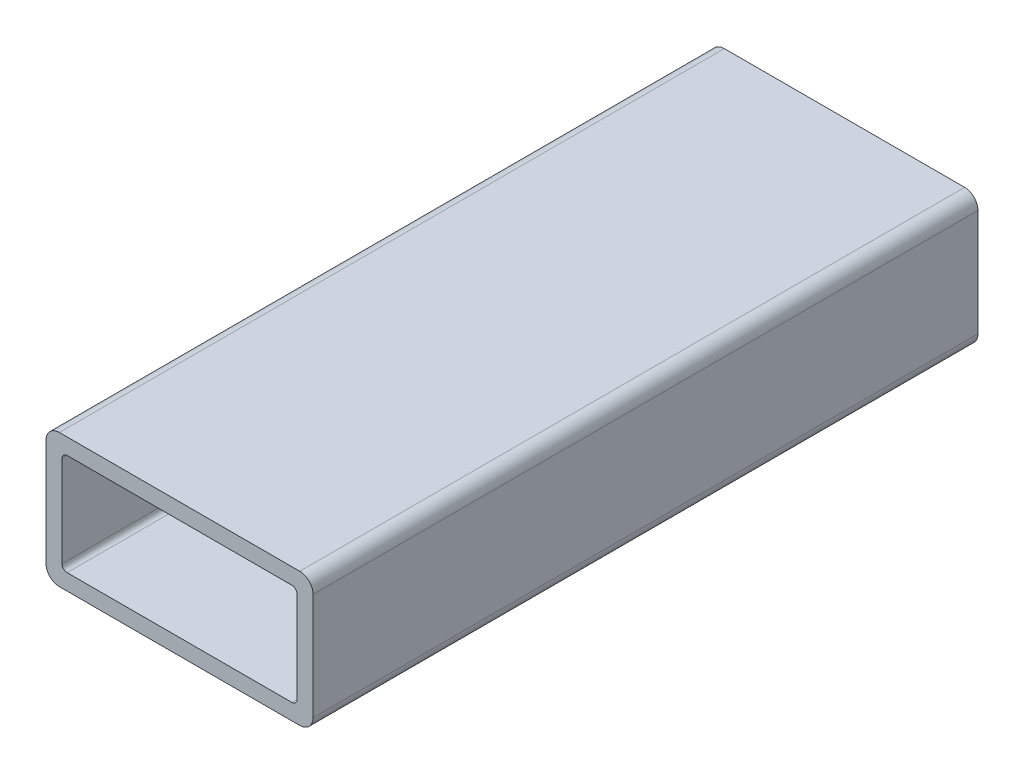
ISO-10303-21;
HEADER;
FILE_DESCRIPTION(('STEP AP214'),'2;1');
FILE_NAME('part.step','',(''),(''),'','','');
FILE_SCHEMA(('AUTOMOTIVE_DESIGN { 1 0 10303 214 1 1 1 1 }'));
ENDSEC;
DATA;
#1=APPLICATION_CONTEXT('core data for automotive mechanical design processes');
#2=APPLICATION_PROTOCOL_DEFINITION('international standard','automotive_design',2000,#1);
#3=PRODUCT_CONTEXT('',#1,'mechanical');
#4=PRODUCT('Part','Part','',(#3));
#5=PRODUCT_RELATED_PRODUCT_CATEGORY('part','',(#4));
#6=PRODUCT_DEFINITION_FORMATION('','',#4);
#7=PRODUCT_DEFINITION_CONTEXT('part definition',#1,'design');
#8=PRODUCT_DEFINITION('design','',#6,#7);
#9=PRODUCT_DEFINITION_SHAPE('','',#8);
#10=(LENGTH_UNIT() NAMED_UNIT(*) SI_UNIT(.MILLI.,.METRE.));
#11=(NAMED_UNIT(*) PLANE_ANGLE_UNIT() SI_UNIT($,.RADIAN.));
#12=(NAMED_UNIT(*) SI_UNIT($,.STERADIAN.) SOLID_ANGLE_UNIT());
#13=UNCERTAINTY_MEASURE_WITH_UNIT(LENGTH_MEASURE(1.E-05),#10,'distance_accuracy_value','');
#14=(GEOMETRIC_REPRESENTATION_CONTEXT(3) GLOBAL_UNCERTAINTY_ASSIGNED_CONTEXT((#13)) GLOBAL_UNIT_ASSIGNED_CONTEXT((#10,
#11,#12)) REPRESENTATION_CONTEXT('',''));
#15=CARTESIAN_POINT('',(0.,0.,0.));
#16=DIRECTION('',(0.,0.,1.));
#17=DIRECTION('',(1.,0.,0.));
#18=AXIS2_PLACEMENT_3D('',#15,#16,#17);
#19=CARTESIAN_POINT('',(22.86,-10.16,126.48184));
#20=DIRECTION('',(0.,0.,1.));
#21=DIRECTION('',(1.,0.,0.));
#22=AXIS2_PLACEMENT_3D('',#19,#20,#21);
#23=PLANE('',#22);
#24=CARTESIAN_POINT('',(22.86,-10.16,126.48184));
#25=DIRECTION('',(0.,0.,1.));
#26=DIRECTION('',(1.,0.,0.));
#27=AXIS2_PLACEMENT_3D('',#24,#25,#26);
#28=CIRCLE('',#27,2.54);
#29=CARTESIAN_POINT('',(22.86,-12.7,126.48184));
#30=VERTEX_POINT('',#29);
#31=CARTESIAN_POINT('',(25.4,-10.16,126.48184));
#32=VERTEX_POINT('',#31);
#33=EDGE_CURVE('E244',#30,#32,#28,.T.);
#34=ORIENTED_EDGE('',*,*,#33,.T.);
#35=DIRECTION('',(0.,1.,0.));
#36=VECTOR('',#35,1.);
#37=CARTESIAN_POINT('',(25.4,-10.16,126.48184));
#38=LINE('',#37,#36);
#39=CARTESIAN_POINT('',(25.4,10.16,126.48184));
#40=VERTEX_POINT('',#39);
#41=EDGE_CURVE('E248',#32,#40,#38,.T.);
#42=ORIENTED_EDGE('',*,*,#41,.T.);
#43=CARTESIAN_POINT('',(22.86,10.16,126.48184));
#44=DIRECTION('',(0.,0.,1.));
#45=DIRECTION('',(1.,0.,0.));
#46=AXIS2_PLACEMENT_3D('',#43,#44,#45);
#47=CIRCLE('',#46,2.54);
#48=CARTESIAN_POINT('',(22.86,12.7,126.48184));
#49=VERTEX_POINT('',#48);
#50=EDGE_CURVE('E252',#40,#49,#47,.T.);
#51=ORIENTED_EDGE('',*,*,#50,.T.);
#52=DIRECTION('',(-1.,0.,0.));
#53=VECTOR('',#52,1.);
#54=CARTESIAN_POINT('',(22.86,12.7,126.48184));
#55=LINE('',#54,#53);
#56=CARTESIAN_POINT('',(-22.86,12.7,126.48184));
#57=VERTEX_POINT('',#56);
#58=EDGE_CURVE('E255',#49,#57,#55,.T.);
#59=ORIENTED_EDGE('',*,*,#58,.T.);
#60=CARTESIAN_POINT('',(-22.86,10.16,126.48184));
#61=DIRECTION('',(0.,0.,1.));
#62=DIRECTION('',(1.,0.,0.));
#63=AXIS2_PLACEMENT_3D('',#60,#61,#62);
#64=CIRCLE('',#63,2.54);
#65=CARTESIAN_POINT('',(-25.4,10.16,126.48184));
#66=VERTEX_POINT('',#65);
#67=EDGE_CURVE('E258',#57,#66,#64,.T.);
#68=ORIENTED_EDGE('',*,*,#67,.T.);
#69=DIRECTION('',(0.,-1.,0.));
#70=VECTOR('',#69,1.);
#71=CARTESIAN_POINT('',(-25.4,-10.16,126.48184));
#72=LINE('',#71,#70);
#73=CARTESIAN_POINT('',(-25.4,-10.16,126.48184));
#74=VERTEX_POINT('',#73);
#75=EDGE_CURVE('E261',#66,#74,#72,.T.);
#76=ORIENTED_EDGE('',*,*,#75,.T.);
#77=CARTESIAN_POINT('',(-22.86,-10.16,126.48184));
#78=DIRECTION('',(0.,0.,1.));
#79=DIRECTION('',(1.,0.,0.));
#80=AXIS2_PLACEMENT_3D('',#77,#78,#79);
#81=CIRCLE('',#80,2.54);
#82=CARTESIAN_POINT('',(-22.86,-12.7,126.48184));
#83=VERTEX_POINT('',#82);
#84=EDGE_CURVE('E264',#74,#83,#81,.T.);
#85=ORIENTED_EDGE('',*,*,#84,.T.);
#86=DIRECTION('',(1.,0.,0.));
#87=VECTOR('',#86,1.);
#88=CARTESIAN_POINT('',(22.86,-12.7,126.48184));
#89=LINE('',#88,#87);
#90=EDGE_CURVE('E267',#83,#30,#89,.T.);
#91=ORIENTED_EDGE('',*,*,#90,.T.);
#92=EDGE_LOOP('',(#34,#42,#51,#59,#68,#76,#85,#91));
#93=FACE_BOUND('',#92,.T.);
#94=DIRECTION('',(-1.,0.,0.));
#95=VECTOR('',#94,1.);
#96=CARTESIAN_POINT('',(21.3868,9.65199999999999,126.48184));
#97=LINE('',#96,#95);
#98=CARTESIAN_POINT('',(21.3868,9.65199999999999,126.48184));
#99=VERTEX_POINT('',#98);
#100=CARTESIAN_POINT('',(-21.3868,9.652,126.48184));
#101=VERTEX_POINT('',#100);
#102=EDGE_CURVE('E164',#99,#101,#97,.T.);
#103=ORIENTED_EDGE('',*,*,#102,.F.);
#104=CARTESIAN_POINT('',(21.3868,8.6868,126.48184));
#105=DIRECTION('',(0.,0.,1.));
#106=DIRECTION('',(1.,0.,0.));
#107=AXIS2_PLACEMENT_3D('',#104,#105,#106);
#108=CIRCLE('',#107,0.965199999999993);
#109=CARTESIAN_POINT('',(22.352,8.68680000000001,126.48184));
#110=VERTEX_POINT('',#109);
#111=EDGE_CURVE('E155',#110,#99,#108,.T.);
#112=ORIENTED_EDGE('',*,*,#111,.F.);
#113=DIRECTION('',(0.,1.,0.));
#114=VECTOR('',#113,1.);
#115=CARTESIAN_POINT('',(22.352,8.68680000000001,126.48184));
#116=LINE('',#115,#114);
#117=CARTESIAN_POINT('',(22.352,-8.6868,126.48184));
#118=VERTEX_POINT('',#117);
#119=EDGE_CURVE('E196',#118,#110,#116,.T.);
#120=ORIENTED_EDGE('',*,*,#119,.F.);
#121=CARTESIAN_POINT('',(21.3868,-8.6868,126.48184));
#122=DIRECTION('',(0.,0.,1.));
#123=DIRECTION('',(1.,0.,0.));
#124=AXIS2_PLACEMENT_3D('',#121,#122,#123);
#125=CIRCLE('',#124,0.965199999999999);
#126=CARTESIAN_POINT('',(21.3868,-9.652,126.48184));
#127=VERTEX_POINT('',#126);
#128=EDGE_CURVE('E193',#127,#118,#125,.T.);
#129=ORIENTED_EDGE('',*,*,#128,.F.);
#130=DIRECTION('',(1.,0.,0.));
#131=VECTOR('',#130,1.);
#132=CARTESIAN_POINT('',(21.3868,-9.652,126.48184));
#133=LINE('',#132,#131);
#134=CARTESIAN_POINT('',(-21.3868,-9.652,126.48184));
#135=VERTEX_POINT('',#134);
#136=EDGE_CURVE('E190',#135,#127,#133,.T.);
#137=ORIENTED_EDGE('',*,*,#136,.F.);
#138=CARTESIAN_POINT('',(-21.3868,-8.6868,126.48184));
#139=DIRECTION('',(0.,0.,1.));
#140=DIRECTION('',(1.,0.,0.));
#141=AXIS2_PLACEMENT_3D('',#138,#139,#140);
#142=CIRCLE('',#141,0.965199999999999);
#143=CARTESIAN_POINT('',(-22.352,-8.6868,126.48184));
#144=VERTEX_POINT('',#143);
#145=EDGE_CURVE('E187',#144,#135,#142,.T.);
#146=ORIENTED_EDGE('',*,*,#145,.F.);
#147=DIRECTION('',(0.,-1.,0.));
#148=VECTOR('',#147,1.);
#149=CARTESIAN_POINT('',(-22.352,8.6868,126.48184));
#150=LINE('',#149,#148);
#151=CARTESIAN_POINT('',(-22.352,8.6868,126.48184));
#152=VERTEX_POINT('',#151);
#153=EDGE_CURVE('E182',#152,#144,#150,.T.);
#154=ORIENTED_EDGE('',*,*,#153,.F.);
#155=CARTESIAN_POINT('',(-21.3868,8.6868,126.48184));
#156=DIRECTION('',(0.,0.,1.));
#157=DIRECTION('',(1.,0.,0.));
#158=AXIS2_PLACEMENT_3D('',#155,#156,#157);
#159=CIRCLE('',#158,0.965199999999999);
#160=EDGE_CURVE('E178',#101,#152,#159,.T.);
#161=ORIENTED_EDGE('',*,*,#160,.F.);
#162=EDGE_LOOP('',(#103,#112,#120,#129,#137,#146,#154,#161));
#163=FACE_BOUND('',#162,.T.);
#164=ADVANCED_FACE('F41',(#93,#163),#23,.T.);
#165=CARTESIAN_POINT('',(22.86,-10.16,0.));
#166=DIRECTION('',(0.,0.,1.));
#167=DIRECTION('',(1.,0.,0.));
#168=AXIS2_PLACEMENT_3D('',#165,#166,#167);
#169=PLANE('',#168);
#170=CARTESIAN_POINT('',(22.86,-10.16,0.));
#171=DIRECTION('',(0.,0.,1.));
#172=DIRECTION('',(1.,0.,0.));
#173=AXIS2_PLACEMENT_3D('',#170,#171,#172);
#174=CIRCLE('',#173,2.54);
#175=CARTESIAN_POINT('',(22.86,-12.7,0.));
#176=VERTEX_POINT('',#175);
#177=CARTESIAN_POINT('',(25.4,-10.16,0.));
#178=VERTEX_POINT('',#177);
#179=EDGE_CURVE('E173',#176,#178,#174,.T.);
#180=ORIENTED_EDGE('',*,*,#179,.F.);
#181=DIRECTION('',(1.,0.,0.));
#182=VECTOR('',#181,1.);
#183=CARTESIAN_POINT('',(22.86,-12.7,0.));
#184=LINE('',#183,#182);
#185=CARTESIAN_POINT('',(-22.86,-12.7,0.));
#186=VERTEX_POINT('',#185);
#187=EDGE_CURVE('E249',#186,#176,#184,.T.);
#188=ORIENTED_EDGE('',*,*,#187,.F.);
#189=CARTESIAN_POINT('',(-22.86,-10.16,0.));
#190=DIRECTION('',(0.,0.,1.));
#191=DIRECTION('',(1.,0.,0.));
#192=AXIS2_PLACEMENT_3D('',#189,#190,#191);
#193=CIRCLE('',#192,2.54);
#194=CARTESIAN_POINT('',(-25.4,-10.16,0.));
#195=VERTEX_POINT('',#194);
#196=EDGE_CURVE('E289',#195,#186,#193,.T.);
#197=ORIENTED_EDGE('',*,*,#196,.F.);
#198=DIRECTION('',(0.,-1.,0.));
#199=VECTOR('',#198,1.);
#200=CARTESIAN_POINT('',(-25.4,-10.16,0.));
#201=LINE('',#200,#199);
#202=CARTESIAN_POINT('',(-25.4,10.16,0.));
#203=VERTEX_POINT('',#202);
#204=EDGE_CURVE('E286',#203,#195,#201,.T.);
#205=ORIENTED_EDGE('',*,*,#204,.F.);
#206=CARTESIAN_POINT('',(-22.86,10.16,0.));
#207=DIRECTION('',(0.,0.,1.));
#208=DIRECTION('',(1.,0.,0.));
#209=AXIS2_PLACEMENT_3D('',#206,#207,#208);
#210=CIRCLE('',#209,2.54);
#211=CARTESIAN_POINT('',(-22.86,12.7,0.));
#212=VERTEX_POINT('',#211);
#213=EDGE_CURVE('E283',#212,#203,#210,.T.);
#214=ORIENTED_EDGE('',*,*,#213,.F.);
#215=DIRECTION('',(-1.,0.,0.));
#216=VECTOR('',#215,1.);
#217=CARTESIAN_POINT('',(22.86,12.7,0.));
#218=LINE('',#217,#216);
#219=CARTESIAN_POINT('',(22.86,12.7,0.));
#220=VERTEX_POINT('',#219);
#221=EDGE_CURVE('E280',#220,#212,#218,.T.);
#222=ORIENTED_EDGE('',*,*,#221,.F.);
#223=CARTESIAN_POINT('',(22.86,10.16,0.));
#224=DIRECTION('',(0.,0.,1.));
#225=DIRECTION('',(1.,0.,0.));
#226=AXIS2_PLACEMENT_3D('',#223,#224,#225);
#227=CIRCLE('',#226,2.54);
#228=CARTESIAN_POINT('',(25.4,10.16,0.));
#229=VERTEX_POINT('',#228);
#230=EDGE_CURVE('E277',#229,#220,#227,.T.);
#231=ORIENTED_EDGE('',*,*,#230,.F.);
#232=DIRECTION('',(0.,1.,0.));
#233=VECTOR('',#232,1.);
#234=CARTESIAN_POINT('',(25.4,-10.16,0.));
#235=LINE('',#234,#233);
#236=EDGE_CURVE('E274',#178,#229,#235,.T.);
#237=ORIENTED_EDGE('',*,*,#236,.F.);
#238=EDGE_LOOP('',(#180,#188,#197,#205,#214,#222,#231,#237));
#239=FACE_BOUND('',#238,.T.);
#240=CARTESIAN_POINT('',(21.3868,8.6868,0.));
#241=DIRECTION('',(0.,0.,1.));
#242=DIRECTION('',(1.,0.,0.));
#243=AXIS2_PLACEMENT_3D('',#240,#241,#242);
#244=CIRCLE('',#243,0.965199999999993);
#245=CARTESIAN_POINT('',(22.352,8.68680000000001,0.));
#246=VERTEX_POINT('',#245);
#247=CARTESIAN_POINT('',(21.3868,9.65199999999999,0.));
#248=VERTEX_POINT('',#247);
#249=EDGE_CURVE('E65',#246,#248,#244,.T.);
#250=ORIENTED_EDGE('',*,*,#249,.T.);
#251=DIRECTION('',(-1.,0.,0.));
#252=VECTOR('',#251,1.);
#253=CARTESIAN_POINT('',(21.3868,9.65199999999999,0.));
#254=LINE('',#253,#252);
#255=CARTESIAN_POINT('',(-21.3868,9.652,0.));
#256=VERTEX_POINT('',#255);
#257=EDGE_CURVE('E171',#248,#256,#254,.T.);
#258=ORIENTED_EDGE('',*,*,#257,.T.);
#259=CARTESIAN_POINT('',(-21.3868,8.6868,0.));
#260=DIRECTION('',(0.,0.,1.));
#261=DIRECTION('',(1.,0.,0.));
#262=AXIS2_PLACEMENT_3D('',#259,#260,#261);
#263=CIRCLE('',#262,0.965199999999999);
#264=CARTESIAN_POINT('',(-22.352,8.6868,0.));
#265=VERTEX_POINT('',#264);
#266=EDGE_CURVE('E203',#256,#265,#263,.T.);
#267=ORIENTED_EDGE('',*,*,#266,.T.);
#268=DIRECTION('',(0.,-1.,0.));
#269=VECTOR('',#268,1.);
#270=CARTESIAN_POINT('',(-22.352,8.6868,0.));
#271=LINE('',#270,#269);
#272=CARTESIAN_POINT('',(-22.352,-8.6868,0.));
#273=VERTEX_POINT('',#272);
#274=EDGE_CURVE('E207',#265,#273,#271,.T.);
#275=ORIENTED_EDGE('',*,*,#274,.T.);
#276=CARTESIAN_POINT('',(-21.3868,-8.6868,0.));
#277=DIRECTION('',(0.,0.,1.));
#278=DIRECTION('',(1.,0.,0.));
#279=AXIS2_PLACEMENT_3D('',#276,#277,#278);
#280=CIRCLE('',#279,0.965199999999999);
#281=CARTESIAN_POINT('',(-21.3868,-9.652,0.));
#282=VERTEX_POINT('',#281);
#283=EDGE_CURVE('E211',#273,#282,#280,.T.);
#284=ORIENTED_EDGE('',*,*,#283,.T.);
#285=DIRECTION('',(1.,0.,0.));
#286=VECTOR('',#285,1.);
#287=CARTESIAN_POINT('',(21.3868,-9.652,0.));
#288=LINE('',#287,#286);
#289=CARTESIAN_POINT('',(21.3868,-9.652,0.));
#290=VERTEX_POINT('',#289);
#291=EDGE_CURVE('E215',#282,#290,#288,.T.);
#292=ORIENTED_EDGE('',*,*,#291,.T.);
#293=CARTESIAN_POINT('',(21.3868,-8.6868,0.));
#294=DIRECTION('',(0.,0.,1.));
#295=DIRECTION('',(1.,0.,0.));
#296=AXIS2_PLACEMENT_3D('',#293,#294,#295);
#297=CIRCLE('',#296,0.965199999999999);
#298=CARTESIAN_POINT('',(22.352,-8.6868,0.));
#299=VERTEX_POINT('',#298);
#300=EDGE_CURVE('E219',#290,#299,#297,.T.);
#301=ORIENTED_EDGE('',*,*,#300,.T.);
#302=DIRECTION('',(0.,1.,0.));
#303=VECTOR('',#302,1.);
#304=CARTESIAN_POINT('',(22.352,8.68680000000001,0.));
#305=LINE('',#304,#303);
#306=EDGE_CURVE('E165',#299,#246,#305,.T.);
#307=ORIENTED_EDGE('',*,*,#306,.T.);
#308=EDGE_LOOP('',(#250,#258,#267,#275,#284,#292,#301,#307));
#309=FACE_BOUND('',#308,.T.);
#310=ADVANCED_FACE('F328',(#239,#309),#169,.F.);
#311=CARTESIAN_POINT('',(22.86,-10.16,126.48184));
#312=DIRECTION('',(0.,0.,-1.));
#313=DIRECTION('',(-1.,0.,0.));
#314=AXIS2_PLACEMENT_3D('',#311,#312,#313);
#315=CYLINDRICAL_SURFACE('',#314,2.54);
#316=ORIENTED_EDGE('',*,*,#179,.T.);
#317=DIRECTION('',(0.,0.,-1.));
#318=VECTOR('',#317,1.);
#319=CARTESIAN_POINT('',(25.4,-10.16,126.48184));
#320=LINE('',#319,#318);
#321=EDGE_CURVE('E11',#32,#178,#320,.T.);
#322=ORIENTED_EDGE('',*,*,#321,.F.);
#323=ORIENTED_EDGE('',*,*,#33,.F.);
#324=DIRECTION('',(0.,0.,-1.));
#325=VECTOR('',#324,1.);
#326=CARTESIAN_POINT('',(22.86,-12.7,126.48184));
#327=LINE('',#326,#325);
#328=EDGE_CURVE('E270',#30,#176,#327,.T.);
#329=ORIENTED_EDGE('',*,*,#328,.T.);
#330=EDGE_LOOP('',(#316,#322,#323,#329));
#331=FACE_BOUND('',#330,.T.);
#332=ADVANCED_FACE('F43',(#331),#315,.T.);
#333=CARTESIAN_POINT('',(25.4,-10.16,126.48184));
#334=DIRECTION('',(-1.,0.,0.));
#335=DIRECTION('',(0.,0.,1.));
#336=AXIS2_PLACEMENT_3D('',#333,#334,#335);
#337=PLANE('',#336);
#338=ORIENTED_EDGE('',*,*,#236,.T.);
#339=DIRECTION('',(0.,0.,-1.));
#340=VECTOR('',#339,1.);
#341=CARTESIAN_POINT('',(25.4,10.16,126.48184));
#342=LINE('',#341,#340);
#343=EDGE_CURVE('E50',#40,#229,#342,.T.);
#344=ORIENTED_EDGE('',*,*,#343,.F.);
#345=ORIENTED_EDGE('',*,*,#41,.F.);
#346=ORIENTED_EDGE('',*,*,#321,.T.);
#347=EDGE_LOOP('',(#338,#344,#345,#346));
#348=FACE_BOUND('',#347,.T.);
#349=ADVANCED_FACE('F345',(#348),#337,.F.);
#350=CARTESIAN_POINT('',(22.86,10.16,126.48184));
#351=DIRECTION('',(0.,0.,-1.));
#352=DIRECTION('',(-1.,0.,0.));
#353=AXIS2_PLACEMENT_3D('',#350,#351,#352);
#354=CYLINDRICAL_SURFACE('',#353,2.54);
#355=ORIENTED_EDGE('',*,*,#230,.T.);
#356=DIRECTION('',(0.,0.,-1.));
#357=VECTOR('',#356,1.);
#358=CARTESIAN_POINT('',(22.86,12.7,126.48184));
#359=LINE('',#358,#357);
#360=EDGE_CURVE('E313',#49,#220,#359,.T.);
#361=ORIENTED_EDGE('',*,*,#360,.F.);
#362=ORIENTED_EDGE('',*,*,#50,.F.);
#363=ORIENTED_EDGE('',*,*,#343,.T.);
#364=EDGE_LOOP('',(#355,#361,#362,#363));
#365=FACE_BOUND('',#364,.T.);
#366=ADVANCED_FACE('F322',(#365),#354,.T.);
#367=CARTESIAN_POINT('',(22.86,12.7,126.48184));
#368=DIRECTION('',(0.,-1.,0.));
#369=DIRECTION('',(0.,0.,-1.));
#370=AXIS2_PLACEMENT_3D('',#367,#368,#369);
#371=PLANE('',#370);
#372=ORIENTED_EDGE('',*,*,#221,.T.);
#373=DIRECTION('',(0.,0.,-1.));
#374=VECTOR('',#373,1.);
#375=CARTESIAN_POINT('',(-22.86,12.7,126.48184));
#376=LINE('',#375,#374);
#377=EDGE_CURVE('E309',#57,#212,#376,.T.);
#378=ORIENTED_EDGE('',*,*,#377,.F.);
#379=ORIENTED_EDGE('',*,*,#58,.F.);
#380=ORIENTED_EDGE('',*,*,#360,.T.);
#381=EDGE_LOOP('',(#372,#378,#379,#380));
#382=FACE_BOUND('',#381,.T.);
#383=ADVANCED_FACE('F334',(#382),#371,.F.);
#384=CARTESIAN_POINT('',(-22.86,10.16,126.48184));
#385=DIRECTION('',(0.,0.,-1.));
#386=DIRECTION('',(-1.,0.,0.));
#387=AXIS2_PLACEMENT_3D('',#384,#385,#386);
#388=CYLINDRICAL_SURFACE('',#387,2.54);
#389=ORIENTED_EDGE('',*,*,#213,.T.);
#390=DIRECTION('',(0.,0.,-1.));
#391=VECTOR('',#390,1.);
#392=CARTESIAN_POINT('',(-25.4,10.16,126.48184));
#393=LINE('',#392,#391);
#394=EDGE_CURVE('E305',#66,#203,#393,.T.);
#395=ORIENTED_EDGE('',*,*,#394,.F.);
#396=ORIENTED_EDGE('',*,*,#67,.F.);
#397=ORIENTED_EDGE('',*,*,#377,.T.);
#398=EDGE_LOOP('',(#389,#395,#396,#397));
#399=FACE_BOUND('',#398,.T.);
#400=ADVANCED_FACE('F338',(#399),#388,.T.);
#401=CARTESIAN_POINT('',(-25.4,-10.16,126.48184));
#402=DIRECTION('',(1.,0.,0.));
#403=DIRECTION('',(0.,0.,-1.));
#404=AXIS2_PLACEMENT_3D('',#401,#402,#403);
#405=PLANE('',#404);
#406=ORIENTED_EDGE('',*,*,#204,.T.);
#407=DIRECTION('',(0.,0.,-1.));
#408=VECTOR('',#407,1.);
#409=CARTESIAN_POINT('',(-25.4,-10.16,126.48184));
#410=LINE('',#409,#408);
#411=EDGE_CURVE('E301',#74,#195,#410,.T.);
#412=ORIENTED_EDGE('',*,*,#411,.F.);
#413=ORIENTED_EDGE('',*,*,#75,.F.);
#414=ORIENTED_EDGE('',*,*,#394,.T.);
#415=EDGE_LOOP('',(#406,#412,#413,#414));
#416=FACE_BOUND('',#415,.T.);
#417=ADVANCED_FACE('F358',(#416),#405,.F.);
#418=CARTESIAN_POINT('',(-22.86,-10.16,126.48184));
#419=DIRECTION('',(0.,0.,-1.));
#420=DIRECTION('',(-1.,0.,0.));
#421=AXIS2_PLACEMENT_3D('',#418,#419,#420);
#422=CYLINDRICAL_SURFACE('',#421,2.54);
#423=ORIENTED_EDGE('',*,*,#196,.T.);
#424=DIRECTION('',(0.,0.,-1.));
#425=VECTOR('',#424,1.);
#426=CARTESIAN_POINT('',(-22.86,-12.7,126.48184));
#427=LINE('',#426,#425);
#428=EDGE_CURVE('E297',#83,#186,#427,.T.);
#429=ORIENTED_EDGE('',*,*,#428,.F.);
#430=ORIENTED_EDGE('',*,*,#84,.F.);
#431=ORIENTED_EDGE('',*,*,#411,.T.);
#432=EDGE_LOOP('',(#423,#429,#430,#431));
#433=FACE_BOUND('',#432,.T.);
#434=ADVANCED_FACE('F356',(#433),#422,.T.);
#435=CARTESIAN_POINT('',(22.86,-12.7,126.48184));
#436=DIRECTION('',(0.,1.,0.));
#437=DIRECTION('',(0.,0.,1.));
#438=AXIS2_PLACEMENT_3D('',#435,#436,#437);
#439=PLANE('',#438);
#440=ORIENTED_EDGE('',*,*,#187,.T.);
#441=ORIENTED_EDGE('',*,*,#328,.F.);
#442=ORIENTED_EDGE('',*,*,#90,.F.);
#443=ORIENTED_EDGE('',*,*,#428,.T.);
#444=EDGE_LOOP('',(#440,#441,#442,#443));
#445=FACE_BOUND('',#444,.T.);
#446=ADVANCED_FACE('F351',(#445),#439,.F.);
#447=CARTESIAN_POINT('',(21.3868,8.6868,126.48184));
#448=DIRECTION('',(0.,0.,-1.));
#449=DIRECTION('',(-1.,0.,0.));
#450=AXIS2_PLACEMENT_3D('',#447,#448,#449);
#451=CYLINDRICAL_SURFACE('',#450,0.965199999999993);
#452=ORIENTED_EDGE('',*,*,#249,.F.);
#453=DIRECTION('',(0.,0.,-1.));
#454=VECTOR('',#453,1.);
#455=CARTESIAN_POINT('',(22.352,8.68680000000001,126.48184));
#456=LINE('',#455,#454);
#457=EDGE_CURVE('E159',#110,#246,#456,.T.);
#458=ORIENTED_EDGE('',*,*,#457,.F.);
#459=ORIENTED_EDGE('',*,*,#111,.T.);
#460=DIRECTION('',(0.,0.,-1.));
#461=VECTOR('',#460,1.);
#462=CARTESIAN_POINT('',(21.3868,9.65199999999999,126.48184));
#463=LINE('',#462,#461);
#464=EDGE_CURVE('E158',#99,#248,#463,.T.);
#465=ORIENTED_EDGE('',*,*,#464,.T.);
#466=EDGE_LOOP('',(#452,#458,#459,#465));
#467=FACE_BOUND('',#466,.T.);
#468=ADVANCED_FACE('F157',(#467),#451,.F.);
#469=CARTESIAN_POINT('',(21.3868,9.65199999999999,126.48184));
#470=DIRECTION('',(0.,-1.,0.));
#471=DIRECTION('',(1.,0.,0.));
#472=AXIS2_PLACEMENT_3D('',#469,#470,#471);
#473=PLANE('',#472);
#474=ORIENTED_EDGE('',*,*,#257,.F.);
#475=ORIENTED_EDGE('',*,*,#464,.F.);
#476=ORIENTED_EDGE('',*,*,#102,.T.);
#477=DIRECTION('',(0.,0.,-1.));
#478=VECTOR('',#477,1.);
#479=CARTESIAN_POINT('',(-21.3868,9.652,126.48184));
#480=LINE('',#479,#478);
#481=EDGE_CURVE('E174',#101,#256,#480,.T.);
#482=ORIENTED_EDGE('',*,*,#481,.T.);
#483=EDGE_LOOP('',(#474,#475,#476,#482));
#484=FACE_BOUND('',#483,.T.);
#485=ADVANCED_FACE('F168',(#484),#473,.T.);
#486=CARTESIAN_POINT('',(-21.3868,8.6868,126.48184));
#487=DIRECTION('',(0.,0.,-1.));
#488=DIRECTION('',(-1.,0.,0.));
#489=AXIS2_PLACEMENT_3D('',#486,#487,#488);
#490=CYLINDRICAL_SURFACE('',#489,0.965199999999999);
#491=ORIENTED_EDGE('',*,*,#266,.F.);
#492=ORIENTED_EDGE('',*,*,#481,.F.);
#493=ORIENTED_EDGE('',*,*,#160,.T.);
#494=DIRECTION('',(0.,0.,-1.));
#495=VECTOR('',#494,1.);
#496=CARTESIAN_POINT('',(-22.352,8.6868,126.48184));
#497=LINE('',#496,#495);
#498=EDGE_CURVE('E239',#152,#265,#497,.T.);
#499=ORIENTED_EDGE('',*,*,#498,.T.);
#500=EDGE_LOOP('',(#491,#492,#493,#499));
#501=FACE_BOUND('',#500,.T.);
#502=ADVANCED_FACE('F383',(#501),#490,.F.);
#503=CARTESIAN_POINT('',(-22.352,8.6868,126.48184));
#504=DIRECTION('',(1.,0.,0.));
#505=DIRECTION('',(0.,0.,-1.));
#506=AXIS2_PLACEMENT_3D('',#503,#504,#505);
#507=PLANE('',#506);
#508=ORIENTED_EDGE('',*,*,#274,.F.);
#509=ORIENTED_EDGE('',*,*,#498,.F.);
#510=ORIENTED_EDGE('',*,*,#153,.T.);
#511=DIRECTION('',(0.,0.,-1.));
#512=VECTOR('',#511,1.);
#513=CARTESIAN_POINT('',(-22.352,-8.6868,126.48184));
#514=LINE('',#513,#512);
#515=EDGE_CURVE('E236',#144,#273,#514,.T.);
#516=ORIENTED_EDGE('',*,*,#515,.T.);
#517=EDGE_LOOP('',(#508,#509,#510,#516));
#518=FACE_BOUND('',#517,.T.);
#519=ADVANCED_FACE('F387',(#518),#507,.T.);
#520=CARTESIAN_POINT('',(-21.3868,-8.6868,126.48184));
#521=DIRECTION('',(0.,0.,-1.));
#522=DIRECTION('',(-1.,0.,0.));
#523=AXIS2_PLACEMENT_3D('',#520,#521,#522);
#524=CYLINDRICAL_SURFACE('',#523,0.965199999999999);
#525=ORIENTED_EDGE('',*,*,#283,.F.);
#526=ORIENTED_EDGE('',*,*,#515,.F.);
#527=ORIENTED_EDGE('',*,*,#145,.T.);
#528=DIRECTION('',(0.,0.,-1.));
#529=VECTOR('',#528,1.);
#530=CARTESIAN_POINT('',(-21.3868,-9.652,126.48184));
#531=LINE('',#530,#529);
#532=EDGE_CURVE('E233',#135,#282,#531,.T.);
#533=ORIENTED_EDGE('',*,*,#532,.T.);
#534=EDGE_LOOP('',(#525,#526,#527,#533));
#535=FACE_BOUND('',#534,.T.);
#536=ADVANCED_FACE('F393',(#535),#524,.F.);
#537=CARTESIAN_POINT('',(21.3868,-9.652,126.48184));
#538=DIRECTION('',(0.,1.,0.));
#539=DIRECTION('',(-1.,0.,0.));
#540=AXIS2_PLACEMENT_3D('',#537,#538,#539);
#541=PLANE('',#540);
#542=ORIENTED_EDGE('',*,*,#291,.F.);
#543=ORIENTED_EDGE('',*,*,#532,.F.);
#544=ORIENTED_EDGE('',*,*,#136,.T.);
#545=DIRECTION('',(0.,0.,-1.));
#546=VECTOR('',#545,1.);
#547=CARTESIAN_POINT('',(21.3868,-9.652,126.48184));
#548=LINE('',#547,#546);
#549=EDGE_CURVE('E230',#127,#290,#548,.T.);
#550=ORIENTED_EDGE('',*,*,#549,.T.);
#551=EDGE_LOOP('',(#542,#543,#544,#550));
#552=FACE_BOUND('',#551,.T.);
#553=ADVANCED_FACE('F397',(#552),#541,.T.);
#554=CARTESIAN_POINT('',(21.3868,-8.6868,126.48184));
#555=DIRECTION('',(0.,0.,-1.));
#556=DIRECTION('',(-1.,0.,0.));
#557=AXIS2_PLACEMENT_3D('',#554,#555,#556);
#558=CYLINDRICAL_SURFACE('',#557,0.965199999999999);
#559=ORIENTED_EDGE('',*,*,#300,.F.);
#560=ORIENTED_EDGE('',*,*,#549,.F.);
#561=ORIENTED_EDGE('',*,*,#128,.T.);
#562=DIRECTION('',(0.,0.,-1.));
#563=VECTOR('',#562,1.);
#564=CARTESIAN_POINT('',(22.352,-8.6868,126.48184));
#565=LINE('',#564,#563);
#566=EDGE_CURVE('E57',#118,#299,#565,.T.);
#567=ORIENTED_EDGE('',*,*,#566,.T.);
#568=EDGE_LOOP('',(#559,#560,#561,#567));
#569=FACE_BOUND('',#568,.T.);
#570=ADVANCED_FACE('F401',(#569),#558,.F.);
#571=CARTESIAN_POINT('',(22.352,8.68680000000001,126.48184));
#572=DIRECTION('',(-1.,0.,0.));
#573=DIRECTION('',(0.,-1.,0.));
#574=AXIS2_PLACEMENT_3D('',#571,#572,#573);
#575=PLANE('',#574);
#576=ORIENTED_EDGE('',*,*,#306,.F.);
#577=ORIENTED_EDGE('',*,*,#566,.F.);
#578=ORIENTED_EDGE('',*,*,#119,.T.);
#579=ORIENTED_EDGE('',*,*,#457,.T.);
#580=EDGE_LOOP('',(#576,#577,#578,#579));
#581=FACE_BOUND('',#580,.T.);
#582=ADVANCED_FACE('F405',(#581),#575,.T.);
#583=CLOSED_SHELL('',(#164,#310,#332,#349,#366,#383,#400,#417,#434,#446,#468,#485,#502,#519,
#536,#553,#570,#582));
#584=MANIFOLD_SOLID_BREP('B2',#583);
#585=ADVANCED_BREP_SHAPE_REPRESENTATION('',(#18,#584),#14);
#586=SHAPE_DEFINITION_REPRESENTATION(#9,#585);
ENDSEC;
END-ISO-10303-21;
